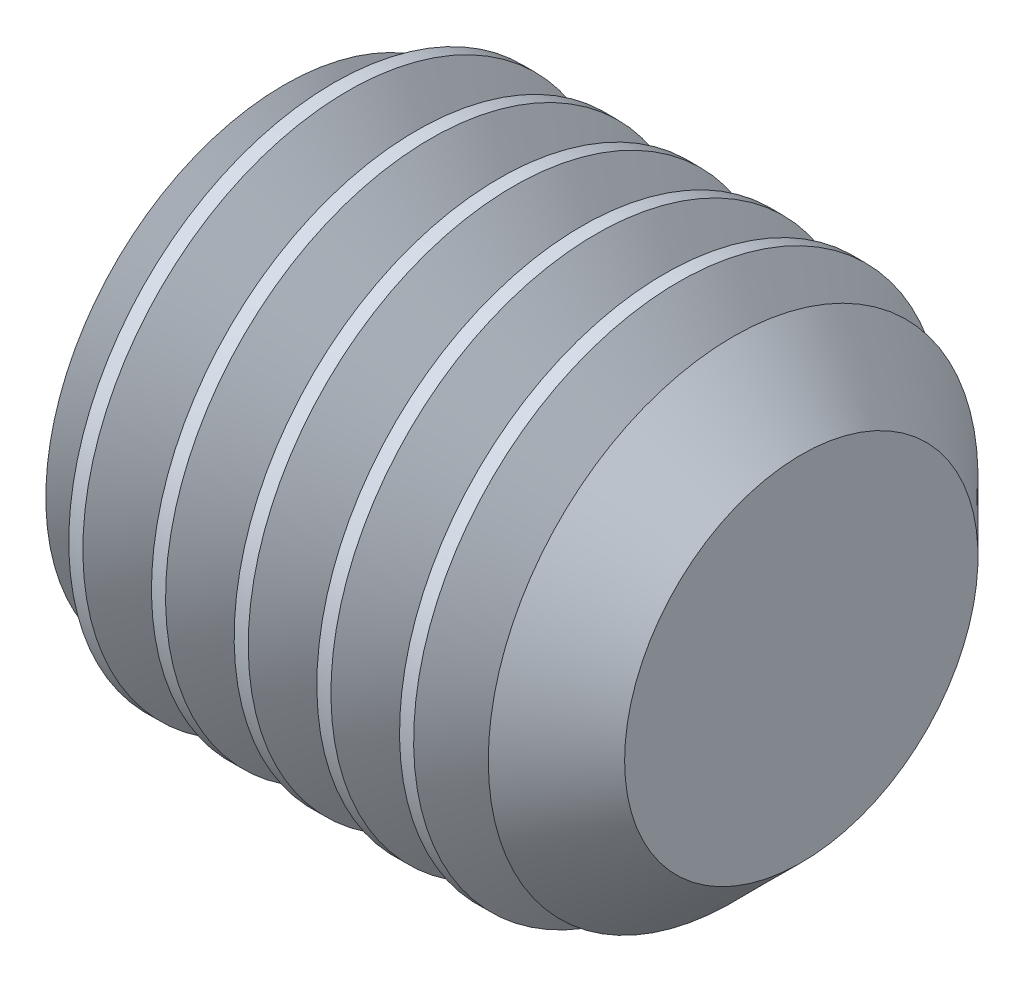
ISO-10303-21;
HEADER;
FILE_DESCRIPTION(('STEP AP214'),'2;1');
FILE_NAME('part.step','',(''),(''),'','','');
FILE_SCHEMA(('AUTOMOTIVE_DESIGN { 1 0 10303 214 1 1 1 1 }'));
ENDSEC;
DATA;
#1=APPLICATION_CONTEXT('core data for automotive mechanical design processes');
#2=APPLICATION_PROTOCOL_DEFINITION('international standard','automotive_design',2000,#1);
#3=PRODUCT_CONTEXT('',#1,'mechanical');
#4=PRODUCT('Part','Part','',(#3));
#5=PRODUCT_RELATED_PRODUCT_CATEGORY('part','',(#4));
#6=PRODUCT_DEFINITION_FORMATION('','',#4);
#7=PRODUCT_DEFINITION_CONTEXT('part definition',#1,'design');
#8=PRODUCT_DEFINITION('design','',#6,#7);
#9=PRODUCT_DEFINITION_SHAPE('','',#8);
#10=(LENGTH_UNIT() NAMED_UNIT(*) SI_UNIT(.MILLI.,.METRE.));
#11=(NAMED_UNIT(*) PLANE_ANGLE_UNIT() SI_UNIT($,.RADIAN.));
#12=(NAMED_UNIT(*) SI_UNIT($,.STERADIAN.) SOLID_ANGLE_UNIT());
#13=UNCERTAINTY_MEASURE_WITH_UNIT(LENGTH_MEASURE(1.E-05),#10,'distance_accuracy_value','');
#14=(GEOMETRIC_REPRESENTATION_CONTEXT(3) GLOBAL_UNCERTAINTY_ASSIGNED_CONTEXT((#13)) GLOBAL_UNIT_ASSIGNED_CONTEXT((#10,
#11,#12)) REPRESENTATION_CONTEXT('',''));
#15=CARTESIAN_POINT('',(0.,0.,0.));
#16=DIRECTION('',(0.,0.,1.));
#17=DIRECTION('',(1.,0.,0.));
#18=AXIS2_PLACEMENT_3D('',#15,#16,#17);
#19=CARTESIAN_POINT('',(2.,1.5,0.866025403784437));
#20=DIRECTION('',(1.,0.,0.));
#21=DIRECTION('',(0.,1.,0.));
#22=AXIS2_PLACEMENT_3D('',#19,#20,#21);
#23=PLANE('',#22);
#24=DIRECTION('',(0.,-0.866025403784438,-0.500000000000002));
#25=VECTOR('',#24,1.);
#26=CARTESIAN_POINT('',(2.,0.,1.3856406460551));
#27=LINE('',#26,#25);
#28=CARTESIAN_POINT('',(2.,0.,1.3856406460551));
#29=VERTEX_POINT('',#28);
#30=CARTESIAN_POINT('',(2.,-1.2,0.69282032302755));
#31=VERTEX_POINT('',#30);
#32=EDGE_CURVE('E138',#29,#31,#27,.T.);
#33=ORIENTED_EDGE('',*,*,#32,.F.);
#34=DIRECTION('',(0.,0.86602540378444,-0.499999999999998));
#35=VECTOR('',#34,1.);
#36=CARTESIAN_POINT('',(2.,0.,1.3856406460551));
#37=LINE('',#36,#35);
#38=CARTESIAN_POINT('',(2.,1.2,0.692820323027553));
#39=VERTEX_POINT('',#38);
#40=EDGE_CURVE('E131',#29,#39,#37,.T.);
#41=ORIENTED_EDGE('',*,*,#40,.T.);
#42=DIRECTION('',(0.,0.,1.));
#43=VECTOR('',#42,1.);
#44=CARTESIAN_POINT('',(2.00000000000001,1.2,0.866025403784438));
#45=LINE('',#44,#43);
#46=CARTESIAN_POINT('',(2.,1.2,-0.692820323027552));
#47=VERTEX_POINT('',#46);
#48=EDGE_CURVE('E119',#47,#39,#45,.T.);
#49=ORIENTED_EDGE('',*,*,#48,.F.);
#50=DIRECTION('',(0.,0.866025403784438,0.500000000000001));
#51=VECTOR('',#50,1.);
#52=CARTESIAN_POINT('',(2.,0.,-1.38564064605511));
#53=LINE('',#52,#51);
#54=CARTESIAN_POINT('',(2.,0.,-1.38564064605511));
#55=VERTEX_POINT('',#54);
#56=EDGE_CURVE('E103',#55,#47,#53,.T.);
#57=ORIENTED_EDGE('',*,*,#56,.F.);
#58=DIRECTION('',(0.,-0.866025403784438,0.500000000000001));
#59=VECTOR('',#58,1.);
#60=CARTESIAN_POINT('',(2.,0.,-1.38564064605511));
#61=LINE('',#60,#59);
#62=CARTESIAN_POINT('',(2.,-1.2,-0.692820323027556));
#63=VERTEX_POINT('',#62);
#64=EDGE_CURVE('E108',#55,#63,#61,.T.);
#65=ORIENTED_EDGE('',*,*,#64,.T.);
#66=DIRECTION('',(0.,0.,1.));
#67=VECTOR('',#66,1.);
#68=CARTESIAN_POINT('',(2.,-1.2,0.866025403784437));
#69=LINE('',#68,#67);
#70=EDGE_CURVE('E141',#63,#31,#69,.T.);
#71=ORIENTED_EDGE('',*,*,#70,.T.);
#72=EDGE_LOOP('',(#33,#41,#49,#57,#65,#71));
#73=FACE_BOUND('',#72,.T.);
#74=ADVANCED_FACE('F17',(#73),#23,.F.);
#75=CARTESIAN_POINT('',(1.70000000000001,-1.5,-0.866025403784441));
#76=DIRECTION('',(0.707106781186545,-0.353553390593275,-0.612372435695797));
#77=DIRECTION('',(-0.65465367070798,0.,-0.755928946018452));
#78=AXIS2_PLACEMENT_3D('',#75,#76,#77);
#79=PLANE('',#78);
#80=DIRECTION('',(0.,-0.866025403784439,0.5));
#81=VECTOR('',#80,1.);
#82=CARTESIAN_POINT('',(1.70000000000001,-1.5,-0.866025403784441));
#83=LINE('',#82,#81);
#84=CARTESIAN_POINT('',(1.70000000000001,-1.5,-0.866025403784441));
#85=VERTEX_POINT('',#84);
#86=CARTESIAN_POINT('',(1.7,0.,-1.73205080756888));
#87=VERTEX_POINT('',#86);
#88=EDGE_CURVE('E146',#85,#87,#83,.F.);
#89=ORIENTED_EDGE('',*,*,#88,.F.);
#90=DIRECTION('',(0.65465367070798,0.654653670707974,0.377964473009228));
#91=VECTOR('',#90,1.);
#92=CARTESIAN_POINT('',(1.7,-1.5,-0.866025403784442));
#93=LINE('',#92,#91);
#94=EDGE_CURVE('E113',#85,#63,#93,.T.);
#95=ORIENTED_EDGE('',*,*,#94,.T.);
#96=ORIENTED_EDGE('',*,*,#64,.F.);
#97=DIRECTION('',(0.65465367070798,0.,0.755928946018453));
#98=VECTOR('',#97,1.);
#99=CARTESIAN_POINT('',(2.6,0.,-0.692820323027556));
#100=LINE('',#99,#98);
#101=EDGE_CURVE('E110',#87,#55,#100,.T.);
#102=ORIENTED_EDGE('',*,*,#101,.F.);
#103=EDGE_LOOP('',(#89,#95,#96,#102));
#104=FACE_BOUND('',#103,.T.);
#105=ADVANCED_FACE('F109',(#104),#79,.F.);
#106=CARTESIAN_POINT('',(2.,2.1,-0.173205080756891));
#107=DIRECTION('',(-0.707106781186545,-0.353553390593275,0.612372435695796));
#108=DIRECTION('',(0.65465367070798,0.,0.755928946018453));
#109=AXIS2_PLACEMENT_3D('',#106,#107,#108);
#110=PLANE('',#109);
#111=ORIENTED_EDGE('',*,*,#101,.T.);
#112=ORIENTED_EDGE('',*,*,#56,.T.);
#113=DIRECTION('',(0.654653670707979,-0.654653670707975,0.377964473009227));
#114=VECTOR('',#113,1.);
#115=CARTESIAN_POINT('',(1.7,1.5,-0.86602540378444));
#116=LINE('',#115,#114);
#117=CARTESIAN_POINT('',(1.7,1.5,-0.86602540378444));
#118=VERTEX_POINT('',#117);
#119=EDGE_CURVE('E121',#118,#47,#116,.T.);
#120=ORIENTED_EDGE('',*,*,#119,.F.);
#121=DIRECTION('',(0.,0.866025403784439,0.5));
#122=VECTOR('',#121,1.);
#123=CARTESIAN_POINT('',(1.7,1.5,-0.86602540378444));
#124=LINE('',#123,#122);
#125=EDGE_CURVE('E125',#118,#87,#124,.F.);
#126=ORIENTED_EDGE('',*,*,#125,.T.);
#127=EDGE_LOOP('',(#111,#112,#120,#126));
#128=FACE_BOUND('',#127,.T.);
#129=ADVANCED_FACE('F123',(#128),#110,.T.);
#130=CARTESIAN_POINT('',(2.,1.2,0.866025403784438));
#131=DIRECTION('',(-0.707106781186545,-0.70710678118655,0.));
#132=DIRECTION('',(0.70710678118655,-0.707106781186545,0.));
#133=AXIS2_PLACEMENT_3D('',#130,#131,#132);
#134=PLANE('',#133);
#135=DIRECTION('',(-0.65465367070798,0.654653670707974,0.377964473009227));
#136=VECTOR('',#135,1.);
#137=CARTESIAN_POINT('',(2.,1.20000000000001,0.692820323027551));
#138=LINE('',#137,#136);
#139=CARTESIAN_POINT('',(1.7,1.5,0.866025403784437));
#140=VERTEX_POINT('',#139);
#141=EDGE_CURVE('E133',#39,#140,#138,.T.);
#142=ORIENTED_EDGE('',*,*,#141,.T.);
#143=DIRECTION('',(0.,0.,1.));
#144=VECTOR('',#143,1.);
#145=CARTESIAN_POINT('',(1.7,1.5,0.866025403784437));
#146=LINE('',#145,#144);
#147=EDGE_CURVE('E151',#140,#118,#146,.F.);
#148=ORIENTED_EDGE('',*,*,#147,.T.);
#149=ORIENTED_EDGE('',*,*,#119,.T.);
#150=ORIENTED_EDGE('',*,*,#48,.T.);
#151=EDGE_LOOP('',(#142,#148,#149,#150));
#152=FACE_BOUND('',#151,.T.);
#153=ADVANCED_FACE('F676',(#152),#134,.T.);
#154=CARTESIAN_POINT('',(1.7,1.5,0.866025403784437));
#155=DIRECTION('',(0.707106781186545,0.353553390593275,0.612372435695797));
#156=DIRECTION('',(0.65465367070798,0.,-0.755928946018452));
#157=AXIS2_PLACEMENT_3D('',#154,#155,#156);
#158=PLANE('',#157);
#159=ORIENTED_EDGE('',*,*,#40,.F.);
#160=DIRECTION('',(-0.65465367070798,0.,0.755928946018452));
#161=VECTOR('',#160,1.);
#162=CARTESIAN_POINT('',(1.74285714285714,0.,1.68256364163834));
#163=LINE('',#162,#161);
#164=CARTESIAN_POINT('',(1.7,0.,1.73205080756888));
#165=VERTEX_POINT('',#164);
#166=EDGE_CURVE('E135',#165,#29,#163,.F.);
#167=ORIENTED_EDGE('',*,*,#166,.F.);
#168=DIRECTION('',(0.,0.866025403784439,-0.5));
#169=VECTOR('',#168,1.);
#170=CARTESIAN_POINT('',(1.7,1.5,0.866025403784437));
#171=LINE('',#170,#169);
#172=EDGE_CURVE('E159',#140,#165,#171,.F.);
#173=ORIENTED_EDGE('',*,*,#172,.F.);
#174=ORIENTED_EDGE('',*,*,#141,.F.);
#175=EDGE_LOOP('',(#159,#167,#173,#174));
#176=FACE_BOUND('',#175,.T.);
#177=ADVANCED_FACE('F666',(#176),#158,.F.);
#178=CARTESIAN_POINT('',(2.,0.899999999999996,1.90525588832577));
#179=DIRECTION('',(-0.707106781186545,0.353553390593275,-0.612372435695797));
#180=DIRECTION('',(-0.65465367070798,0.,0.755928946018452));
#181=AXIS2_PLACEMENT_3D('',#178,#179,#180);
#182=PLANE('',#181);
#183=ORIENTED_EDGE('',*,*,#166,.T.);
#184=ORIENTED_EDGE('',*,*,#32,.T.);
#185=DIRECTION('',(-0.65465367070798,-0.654653670707975,0.377964473009225));
#186=VECTOR('',#185,1.);
#187=CARTESIAN_POINT('',(2.,-1.2,0.69282032302755));
#188=LINE('',#187,#186);
#189=CARTESIAN_POINT('',(1.7,-1.5,0.866025403784438));
#190=VERTEX_POINT('',#189);
#191=EDGE_CURVE('E143',#31,#190,#188,.T.);
#192=ORIENTED_EDGE('',*,*,#191,.T.);
#193=DIRECTION('',(0.,-0.866025403784439,-0.5));
#194=VECTOR('',#193,1.);
#195=CARTESIAN_POINT('',(1.7,-1.5,0.866025403784438));
#196=LINE('',#195,#194);
#197=EDGE_CURVE('E162',#190,#165,#196,.F.);
#198=ORIENTED_EDGE('',*,*,#197,.T.);
#199=EDGE_LOOP('',(#183,#184,#192,#198));
#200=FACE_BOUND('',#199,.T.);
#201=ADVANCED_FACE('F656',(#200),#182,.T.);
#202=CARTESIAN_POINT('',(1.7,-1.5,0.866025403784437));
#203=DIRECTION('',(0.707106781186545,-0.70710678118655,0.));
#204=DIRECTION('',(0.70710678118655,0.707106781186545,0.));
#205=AXIS2_PLACEMENT_3D('',#202,#203,#204);
#206=PLANE('',#205);
#207=DIRECTION('',(0.,0.,1.));
#208=VECTOR('',#207,1.);
#209=CARTESIAN_POINT('',(1.7,-1.5,0.866025403784438));
#210=LINE('',#209,#208);
#211=EDGE_CURVE('E170',#190,#85,#210,.F.);
#212=ORIENTED_EDGE('',*,*,#211,.F.);
#213=ORIENTED_EDGE('',*,*,#191,.F.);
#214=ORIENTED_EDGE('',*,*,#70,.F.);
#215=ORIENTED_EDGE('',*,*,#94,.F.);
#216=EDGE_LOOP('',(#212,#213,#214,#215));
#217=FACE_BOUND('',#216,.T.);
#218=ADVANCED_FACE('F646',(#217),#206,.F.);
#219=CARTESIAN_POINT('',(2.00000000000001,-1.5,-0.866025403784441));
#220=DIRECTION('',(0.,0.5,0.866025403784439));
#221=DIRECTION('',(0.,-0.866025403784439,0.5));
#222=AXIS2_PLACEMENT_3D('',#219,#220,#221);
#223=PLANE('',#222);
#224=DIRECTION('',(1.,0.,0.));
#225=VECTOR('',#224,1.);
#226=CARTESIAN_POINT('',(2.,0.,-1.73205080756888));
#227=LINE('',#226,#225);
#228=CARTESIAN_POINT('',(0.3,0.,-1.73205080756888));
#229=VERTEX_POINT('',#228);
#230=EDGE_CURVE('E149',#87,#229,#227,.F.);
#231=ORIENTED_EDGE('',*,*,#230,.T.);
#232=DIRECTION('',(0.,-0.866025403784438,0.500000000000001));
#233=VECTOR('',#232,1.);
#234=CARTESIAN_POINT('',(0.300000000000003,0.,-1.73205080756888));
#235=LINE('',#234,#233);
#236=CARTESIAN_POINT('',(0.300000000000002,-1.5,-0.866025403784442));
#237=VERTEX_POINT('',#236);
#238=EDGE_CURVE('E176',#229,#237,#235,.T.);
#239=ORIENTED_EDGE('',*,*,#238,.T.);
#240=DIRECTION('',(-1.,0.,0.));
#241=VECTOR('',#240,1.);
#242=CARTESIAN_POINT('',(2.00000000000001,-1.5,-0.866025403784441));
#243=LINE('',#242,#241);
#244=EDGE_CURVE('E173',#85,#237,#243,.T.);
#245=ORIENTED_EDGE('',*,*,#244,.F.);
#246=ORIENTED_EDGE('',*,*,#88,.T.);
#247=EDGE_LOOP('',(#231,#239,#245,#246));
#248=FACE_BOUND('',#247,.T.);
#249=ADVANCED_FACE('F636',(#248),#223,.T.);
#250=CARTESIAN_POINT('',(2.,1.5,-0.86602540378444));
#251=DIRECTION('',(0.,0.5,-0.866025403784439));
#252=DIRECTION('',(0.,0.866025403784439,0.5));
#253=AXIS2_PLACEMENT_3D('',#250,#251,#252);
#254=PLANE('',#253);
#255=ORIENTED_EDGE('',*,*,#125,.F.);
#256=DIRECTION('',(1.,0.,0.));
#257=VECTOR('',#256,1.);
#258=CARTESIAN_POINT('',(2.,1.5,-0.86602540378444));
#259=LINE('',#258,#257);
#260=CARTESIAN_POINT('',(0.300000000000002,1.5,-0.866025403784441));
#261=VERTEX_POINT('',#260);
#262=EDGE_CURVE('E154',#118,#261,#259,.F.);
#263=ORIENTED_EDGE('',*,*,#262,.T.);
#264=DIRECTION('',(0.,0.866025403784437,0.500000000000003));
#265=VECTOR('',#264,1.);
#266=CARTESIAN_POINT('',(0.299999999999999,0.,-1.73205080756888));
#267=LINE('',#266,#265);
#268=EDGE_CURVE('E181',#229,#261,#267,.T.);
#269=ORIENTED_EDGE('',*,*,#268,.F.);
#270=ORIENTED_EDGE('',*,*,#230,.F.);
#271=EDGE_LOOP('',(#255,#263,#269,#270));
#272=FACE_BOUND('',#271,.T.);
#273=ADVANCED_FACE('F626',(#272),#254,.F.);
#274=CARTESIAN_POINT('',(2.,1.5,0.866025403784437));
#275=DIRECTION('',(0.,1.,0.));
#276=DIRECTION('',(0.,0.,1.));
#277=AXIS2_PLACEMENT_3D('',#274,#275,#276);
#278=PLANE('',#277);
#279=ORIENTED_EDGE('',*,*,#147,.F.);
#280=DIRECTION('',(1.,0.,0.));
#281=VECTOR('',#280,1.);
#282=CARTESIAN_POINT('',(2.,1.5,0.866025403784439));
#283=LINE('',#282,#281);
#284=CARTESIAN_POINT('',(0.300000000000003,1.5,0.866025403784438));
#285=VERTEX_POINT('',#284);
#286=EDGE_CURVE('E156',#285,#140,#283,.T.);
#287=ORIENTED_EDGE('',*,*,#286,.F.);
#288=DIRECTION('',(0.,0.,1.));
#289=VECTOR('',#288,1.);
#290=CARTESIAN_POINT('',(0.300000000000005,1.5,0.866025403784438));
#291=LINE('',#290,#289);
#292=EDGE_CURVE('E187',#261,#285,#291,.T.);
#293=ORIENTED_EDGE('',*,*,#292,.F.);
#294=ORIENTED_EDGE('',*,*,#262,.F.);
#295=EDGE_LOOP('',(#279,#287,#293,#294));
#296=FACE_BOUND('',#295,.T.);
#297=ADVANCED_FACE('F616',(#296),#278,.F.);
#298=CARTESIAN_POINT('',(2.,1.5,0.866025403784437));
#299=DIRECTION('',(0.,-0.5,-0.866025403784439));
#300=DIRECTION('',(0.,0.866025403784439,-0.5));
#301=AXIS2_PLACEMENT_3D('',#298,#299,#300);
#302=PLANE('',#301);
#303=DIRECTION('',(1.,0.,0.));
#304=VECTOR('',#303,1.);
#305=CARTESIAN_POINT('',(2.00000000000001,0.,1.73205080756887));
#306=LINE('',#305,#304);
#307=CARTESIAN_POINT('',(0.299999999999998,0.,1.73205080756888));
#308=VERTEX_POINT('',#307);
#309=EDGE_CURVE('E165',#165,#308,#306,.F.);
#310=ORIENTED_EDGE('',*,*,#309,.T.);
#311=DIRECTION('',(0.,0.866025403784439,-0.5));
#312=VECTOR('',#311,1.);
#313=CARTESIAN_POINT('',(0.299999999999998,0.,1.73205080756888));
#314=LINE('',#313,#312);
#315=EDGE_CURVE('E190',#308,#285,#314,.T.);
#316=ORIENTED_EDGE('',*,*,#315,.T.);
#317=ORIENTED_EDGE('',*,*,#286,.T.);
#318=ORIENTED_EDGE('',*,*,#172,.T.);
#319=EDGE_LOOP('',(#310,#316,#317,#318));
#320=FACE_BOUND('',#319,.T.);
#321=ADVANCED_FACE('F606',(#320),#302,.T.);
#322=CARTESIAN_POINT('',(2.00000000000001,-1.5,0.866025403784438));
#323=DIRECTION('',(0.,-0.5,0.866025403784439));
#324=DIRECTION('',(0.,-0.866025403784439,-0.5));
#325=AXIS2_PLACEMENT_3D('',#322,#323,#324);
#326=PLANE('',#325);
#327=ORIENTED_EDGE('',*,*,#197,.F.);
#328=DIRECTION('',(-1.,0.,0.));
#329=VECTOR('',#328,1.);
#330=CARTESIAN_POINT('',(2.00000000000001,-1.5,0.866025403784438));
#331=LINE('',#330,#329);
#332=CARTESIAN_POINT('',(0.300000000000001,-1.5,0.866025403784438));
#333=VERTEX_POINT('',#332);
#334=EDGE_CURVE('E167',#333,#190,#331,.F.);
#335=ORIENTED_EDGE('',*,*,#334,.F.);
#336=DIRECTION('',(0.,-0.866025403784437,-0.500000000000003));
#337=VECTOR('',#336,1.);
#338=CARTESIAN_POINT('',(0.299999999999999,0.,1.73205080756888));
#339=LINE('',#338,#337);
#340=EDGE_CURVE('E198',#308,#333,#339,.T.);
#341=ORIENTED_EDGE('',*,*,#340,.F.);
#342=ORIENTED_EDGE('',*,*,#309,.F.);
#343=EDGE_LOOP('',(#327,#335,#341,#342));
#344=FACE_BOUND('',#343,.T.);
#345=ADVANCED_FACE('F596',(#344),#326,.F.);
#346=CARTESIAN_POINT('',(2.00000000000001,-1.5,0.866025403784438));
#347=DIRECTION('',(0.,1.,0.));
#348=DIRECTION('',(-1.,0.,0.));
#349=AXIS2_PLACEMENT_3D('',#346,#347,#348);
#350=PLANE('',#349);
#351=ORIENTED_EDGE('',*,*,#244,.T.);
#352=DIRECTION('',(0.,0.,1.));
#353=VECTOR('',#352,1.);
#354=CARTESIAN_POINT('',(0.300000000000004,-1.5,0.));
#355=LINE('',#354,#353);
#356=EDGE_CURVE('E203',#237,#333,#355,.T.);
#357=ORIENTED_EDGE('',*,*,#356,.T.);
#358=ORIENTED_EDGE('',*,*,#334,.T.);
#359=ORIENTED_EDGE('',*,*,#211,.T.);
#360=EDGE_LOOP('',(#351,#357,#358,#359));
#361=FACE_BOUND('',#360,.T.);
#362=ADVANCED_FACE('F586',(#361),#350,.T.);
#363=CARTESIAN_POINT('',(0.,-0.900000000000007,-1.55884572681199));
#364=DIRECTION('',(0.70710678118655,-0.353553390593272,-0.612372435695793));
#365=DIRECTION('',(-0.654653670707975,0.,-0.755928946018456));
#366=AXIS2_PLACEMENT_3D('',#363,#364,#365);
#367=PLANE('',#366);
#368=ORIENTED_EDGE('',*,*,#238,.F.);
#369=DIRECTION('',(0.654653670707975,0.,0.755928946018456));
#370=VECTOR('',#369,1.);
#371=CARTESIAN_POINT('',(0.728571428571432,0.,-1.23717914826348));
#372=LINE('',#371,#370);
#373=CARTESIAN_POINT('',(0.,0.,-2.07846096908266));
#374=VERTEX_POINT('',#373);
#375=EDGE_CURVE('E178',#374,#229,#372,.T.);
#376=ORIENTED_EDGE('',*,*,#375,.F.);
#377=DIRECTION('',(0.,0.866025403784438,-0.500000000000001));
#378=VECTOR('',#377,1.);
#379=CARTESIAN_POINT('',(0.,-1.8,-1.03923048454133));
#380=LINE('',#379,#378);
#381=CARTESIAN_POINT('',(0.,-1.8,-1.03923048454133));
#382=VERTEX_POINT('',#381);
#383=EDGE_CURVE('E207',#382,#374,#380,.T.);
#384=ORIENTED_EDGE('',*,*,#383,.F.);
#385=DIRECTION('',(0.654653670707974,0.654653670707977,0.377964473009234));
#386=VECTOR('',#385,1.);
#387=CARTESIAN_POINT('',(0.,-1.8,-1.03923048454133));
#388=LINE('',#387,#386);
#389=EDGE_CURVE('E200',#382,#237,#388,.T.);
#390=ORIENTED_EDGE('',*,*,#389,.T.);
#391=EDGE_LOOP('',(#368,#376,#384,#390));
#392=FACE_BOUND('',#391,.T.);
#393=ADVANCED_FACE('F576',(#392),#367,.F.);
#394=CARTESIAN_POINT('',(0.300000000000005,1.5,-0.86602540378444));
#395=DIRECTION('',(-0.707106781186549,-0.353553390593273,0.612372435695793));
#396=DIRECTION('',(0.654653670707975,0.,0.755928946018456));
#397=AXIS2_PLACEMENT_3D('',#394,#395,#396);
#398=PLANE('',#397);
#399=ORIENTED_EDGE('',*,*,#375,.T.);
#400=ORIENTED_EDGE('',*,*,#268,.T.);
#401=DIRECTION('',(0.654653670707976,-0.65465367070798,0.377964473009223));
#402=VECTOR('',#401,1.);
#403=CARTESIAN_POINT('',(0.,1.8,-1.03923048454133));
#404=LINE('',#403,#402);
#405=CARTESIAN_POINT('',(0.,1.8,-1.03923048454133));
#406=VERTEX_POINT('',#405);
#407=EDGE_CURVE('E184',#406,#261,#404,.T.);
#408=ORIENTED_EDGE('',*,*,#407,.F.);
#409=DIRECTION('',(0.,0.866025403784438,0.500000000000001));
#410=VECTOR('',#409,1.);
#411=CARTESIAN_POINT('',(0.,0.,-2.07846096908266));
#412=LINE('',#411,#410);
#413=EDGE_CURVE('E210',#374,#406,#412,.T.);
#414=ORIENTED_EDGE('',*,*,#413,.F.);
#415=EDGE_LOOP('',(#399,#400,#408,#414));
#416=FACE_BOUND('',#415,.T.);
#417=ADVANCED_FACE('F566',(#416),#398,.T.);
#418=CARTESIAN_POINT('',(0.300000000000002,1.5,0.866025403784438));
#419=DIRECTION('',(-0.707106781186549,-0.707106781186546,0.));
#420=DIRECTION('',(0.707106781186546,-0.707106781186549,0.));
#421=AXIS2_PLACEMENT_3D('',#418,#419,#420);
#422=PLANE('',#421);
#423=ORIENTED_EDGE('',*,*,#407,.T.);
#424=ORIENTED_EDGE('',*,*,#292,.T.);
#425=DIRECTION('',(-0.654653670707978,0.654653670707972,0.377964473009234));
#426=VECTOR('',#425,1.);
#427=CARTESIAN_POINT('',(0.3,1.5,0.866025403784437));
#428=LINE('',#427,#426);
#429=CARTESIAN_POINT('',(0.,1.8,1.03923048454132));
#430=VERTEX_POINT('',#429);
#431=EDGE_CURVE('E193',#285,#430,#428,.T.);
#432=ORIENTED_EDGE('',*,*,#431,.T.);
#433=DIRECTION('',(0.,0.,1.));
#434=VECTOR('',#433,1.);
#435=CARTESIAN_POINT('',(0.,1.8,0.));
#436=LINE('',#435,#434);
#437=EDGE_CURVE('E213',#406,#430,#436,.T.);
#438=ORIENTED_EDGE('',*,*,#437,.F.);
#439=EDGE_LOOP('',(#423,#424,#432,#438));
#440=FACE_BOUND('',#439,.T.);
#441=ADVANCED_FACE('F556',(#440),#422,.T.);
#442=CARTESIAN_POINT('',(0.,0.899999999999995,1.55884572681199));
#443=DIRECTION('',(0.707106781186549,0.353553390593273,0.612372435695794));
#444=DIRECTION('',(0.654653670707976,0.,-0.755928946018456));
#445=AXIS2_PLACEMENT_3D('',#442,#443,#444);
#446=PLANE('',#445);
#447=DIRECTION('',(0.,-0.866025403784438,0.5));
#448=VECTOR('',#447,1.);
#449=CARTESIAN_POINT('',(0.,1.79999999999999,1.03923048454133));
#450=LINE('',#449,#448);
#451=CARTESIAN_POINT('',(0.,0.,2.07846096908265));
#452=VERTEX_POINT('',#451);
#453=EDGE_CURVE('E216',#430,#452,#450,.T.);
#454=ORIENTED_EDGE('',*,*,#453,.F.);
#455=ORIENTED_EDGE('',*,*,#431,.F.);
#456=ORIENTED_EDGE('',*,*,#315,.F.);
#457=DIRECTION('',(-0.654653670707976,0.,0.755928946018456));
#458=VECTOR('',#457,1.);
#459=CARTESIAN_POINT('',(0.728571428571431,0.,1.23717914826348));
#460=LINE('',#459,#458);
#461=EDGE_CURVE('E195',#452,#308,#460,.F.);
#462=ORIENTED_EDGE('',*,*,#461,.F.);
#463=EDGE_LOOP('',(#454,#455,#456,#462));
#464=FACE_BOUND('',#463,.T.);
#465=ADVANCED_FACE('F547',(#464),#446,.F.);
#466=CARTESIAN_POINT('',(0.300000000000005,-1.5,0.866025403784438));
#467=DIRECTION('',(-0.707106781186549,0.353553390593273,-0.612372435695793));
#468=DIRECTION('',(-0.654653670707976,0.,0.755928946018456));
#469=AXIS2_PLACEMENT_3D('',#466,#467,#468);
#470=PLANE('',#469);
#471=ORIENTED_EDGE('',*,*,#461,.T.);
#472=ORIENTED_EDGE('',*,*,#340,.T.);
#473=DIRECTION('',(-0.654653670707977,-0.65465367070798,0.377964473009222));
#474=VECTOR('',#473,1.);
#475=CARTESIAN_POINT('',(0.300000000000006,-1.5,0.866025403784438));
#476=LINE('',#475,#474);
#477=CARTESIAN_POINT('',(0.,-1.8,1.03923048454132));
#478=VERTEX_POINT('',#477);
#479=EDGE_CURVE('E34',#333,#478,#476,.T.);
#480=ORIENTED_EDGE('',*,*,#479,.T.);
#481=DIRECTION('',(0.,-0.866025403784439,-0.5));
#482=VECTOR('',#481,1.);
#483=CARTESIAN_POINT('',(0.,0.,2.07846096908265));
#484=LINE('',#483,#482);
#485=EDGE_CURVE('E219',#452,#478,#484,.T.);
#486=ORIENTED_EDGE('',*,*,#485,.F.);
#487=EDGE_LOOP('',(#471,#472,#480,#486));
#488=FACE_BOUND('',#487,.T.);
#489=ADVANCED_FACE('F537',(#488),#470,.T.);
#490=CARTESIAN_POINT('',(0.,-1.8,0.));
#491=DIRECTION('',(0.707106781186549,-0.707106781186546,0.));
#492=DIRECTION('',(0.707106781186546,0.707106781186549,0.));
#493=AXIS2_PLACEMENT_3D('',#490,#491,#492);
#494=PLANE('',#493);
#495=ORIENTED_EDGE('',*,*,#356,.F.);
#496=ORIENTED_EDGE('',*,*,#389,.F.);
#497=DIRECTION('',(0.,0.,1.));
#498=VECTOR('',#497,1.);
#499=CARTESIAN_POINT('',(0.,-1.80000000000001,0.));
#500=LINE('',#499,#498);
#501=EDGE_CURVE('E222',#478,#382,#500,.F.);
#502=ORIENTED_EDGE('',*,*,#501,.F.);
#503=ORIENTED_EDGE('',*,*,#479,.F.);
#504=EDGE_LOOP('',(#495,#496,#502,#503));
#505=FACE_BOUND('',#504,.T.);
#506=ADVANCED_FACE('F527',(#505),#494,.F.);
#507=CARTESIAN_POINT('',(0.,0.,0.));
#508=DIRECTION('',(-1.,0.,0.));
#509=DIRECTION('',(0.,-1.,0.));
#510=AXIS2_PLACEMENT_3D('',#507,#508,#509);
#511=PLANE('',#510);
#512=CARTESIAN_POINT('',(8.79366566543249E-12,0.,0.));
#513=DIRECTION('',(1.,0.,0.));
#514=DIRECTION('',(0.,1.,0.));
#515=AXIS2_PLACEMENT_3D('',#512,#513,#514);
#516=CIRCLE('',#515,2.44550000002164);
#517=CARTESIAN_POINT('',(8.79353044367804E-12,2.44550000002164,0.));
#518=VERTEX_POINT('',#517);
#519=EDGE_CURVE('E20',#518,#518,#516,.T.);
#520=ORIENTED_EDGE('',*,*,#519,.F.);
#521=EDGE_LOOP('',(#520));
#522=FACE_BOUND('',#521,.T.);
#523=ORIENTED_EDGE('',*,*,#485,.T.);
#524=ORIENTED_EDGE('',*,*,#501,.T.);
#525=ORIENTED_EDGE('',*,*,#383,.T.);
#526=ORIENTED_EDGE('',*,*,#413,.T.);
#527=ORIENTED_EDGE('',*,*,#437,.T.);
#528=ORIENTED_EDGE('',*,*,#453,.T.);
#529=EDGE_LOOP('',(#523,#524,#525,#526,#527,#528));
#530=FACE_BOUND('',#529,.T.);
#531=ADVANCED_FACE('F517',(#522,#530),#511,.T.);
#532=CARTESIAN_POINT('',(0.144677080186284,0.,0.));
#533=DIRECTION('',(1.,0.,0.));
#534=DIRECTION('',(0.,1.,0.));
#535=AXIS2_PLACEMENT_3D('',#532,#533,#534);
#536=CONICAL_SURFACE('',#535,2.69608805359667,1.0471975512258);
#537=ORIENTED_EDGE('',*,*,#519,.T.);
#538=EDGE_LOOP('',(#537));
#539=FACE_BOUND('',#538,.T.);
#540=CARTESIAN_POINT('',(0.144677080243127,0.,0.));
#541=DIRECTION('',(-1.,0.,0.));
#542=DIRECTION('',(0.,-1.,0.));
#543=AXIS2_PLACEMENT_3D('',#540,#541,#542);
#544=CIRCLE('',#543,2.69608805359666);
#545=CARTESIAN_POINT('',(0.144677080243127,-2.69608805359667,0.));
#546=VERTEX_POINT('',#545);
#547=EDGE_CURVE('E227',#546,#546,#544,.F.);
#548=ORIENTED_EDGE('',*,*,#547,.F.);
#549=EDGE_LOOP('',(#548));
#550=FACE_BOUND('',#549,.T.);
#551=ADVANCED_FACE('F507',(#539,#550),#536,.T.);
#552=CARTESIAN_POINT('',(0.144677080186284,0.,0.));
#553=DIRECTION('',(-1.,0.,0.));
#554=DIRECTION('',(0.,-1.,0.));
#555=AXIS2_PLACEMENT_3D('',#552,#553,#554);
#556=CONICAL_SURFACE('',#555,2.69608805371035,0.9599310885988);
#557=CARTESIAN_POINT('',(0.320140724284102,0.,0.));
#558=DIRECTION('',(1.,0.,0.));
#559=DIRECTION('',(0.,1.,0.));
#560=AXIS2_PLACEMENT_3D('',#557,#558,#559);
#561=CIRCLE('',#560,2.44550000002164);
#562=CARTESIAN_POINT('',(0.320140724284101,2.44550000002164,0.));
#563=VERTEX_POINT('',#562);
#564=EDGE_CURVE('E230',#563,#563,#561,.T.);
#565=ORIENTED_EDGE('',*,*,#564,.F.);
#566=EDGE_LOOP('',(#565));
#567=FACE_BOUND('',#566,.T.);
#568=ORIENTED_EDGE('',*,*,#547,.T.);
#569=EDGE_LOOP('',(#568));
#570=FACE_BOUND('',#569,.T.);
#571=ADVANCED_FACE('F497',(#567,#570),#556,.T.);
#572=CARTESIAN_POINT('',(0.708405804232371,0.,0.));
#573=DIRECTION('',(1.,0.,0.));
#574=DIRECTION('',(0.,1.,0.));
#575=AXIS2_PLACEMENT_3D('',#572,#573,#574);
#576=CONICAL_SURFACE('',#575,3.00000000004274,0.959931088601473);
#577=CARTESIAN_POINT('',(0.708405804202929,0.,0.));
#578=DIRECTION('',(-1.,0.,0.));
#579=DIRECTION('',(0.,-1.,0.));
#580=AXIS2_PLACEMENT_3D('',#577,#578,#579);
#581=CIRCLE('',#580,3.);
#582=CARTESIAN_POINT('',(0.708405804202929,-3.,0.));
#583=VERTEX_POINT('',#582);
#584=EDGE_CURVE('E235',#583,#583,#581,.F.);
#585=ORIENTED_EDGE('',*,*,#584,.F.);
#586=EDGE_LOOP('',(#585));
#587=FACE_BOUND('',#586,.T.);
#588=ORIENTED_EDGE('',*,*,#564,.T.);
#589=EDGE_LOOP('',(#588));
#590=FACE_BOUND('',#589,.T.);
#591=ADVANCED_FACE('F487',(#587,#590),#576,.T.);
#592=CARTESIAN_POINT('',(-12.7,0.,0.));
#593=DIRECTION('',(-1.,0.,0.));
#594=DIRECTION('',(0.,-1.,0.));
#595=AXIS2_PLACEMENT_3D('',#592,#593,#594);
#596=CYLINDRICAL_SURFACE('',#595,3.);
#597=ORIENTED_EDGE('',*,*,#584,.T.);
#598=EDGE_LOOP('',(#597));
#599=FACE_BOUND('',#598,.T.);
#600=CARTESIAN_POINT('',(0.867847504252949,0.,0.));
#601=DIRECTION('',(-1.,0.,0.));
#602=DIRECTION('',(0.,-1.,0.));
#603=AXIS2_PLACEMENT_3D('',#600,#601,#602);
#604=CIRCLE('',#603,3.00000000009959);
#605=CARTESIAN_POINT('',(0.86784750425295,-3.00000000009959,0.));
#606=VERTEX_POINT('',#605);
#607=EDGE_CURVE('E240',#606,#606,#604,.F.);
#608=ORIENTED_EDGE('',*,*,#607,.F.);
#609=EDGE_LOOP('',(#608));
#610=FACE_BOUND('',#609,.T.);
#611=ADVANCED_FACE('F477',(#599,#610),#596,.T.);
#612=CARTESIAN_POINT('',(0.867847504196106,0.,0.));
#613=DIRECTION('',(-1.,0.,0.));
#614=DIRECTION('',(0.,-1.,0.));
#615=AXIS2_PLACEMENT_3D('',#612,#613,#614);
#616=CONICAL_SURFACE('',#615,3.00000000015643,0.959931088601473);
#617=CARTESIAN_POINT('',(1.25611258420122,0.,0.));
#618=DIRECTION('',(1.,0.,0.));
#619=DIRECTION('',(0.,1.,0.));
#620=AXIS2_PLACEMENT_3D('',#617,#618,#619);
#621=CIRCLE('',#620,2.44550000002165);
#622=CARTESIAN_POINT('',(1.25611258420122,2.44550000002164,0.));
#623=VERTEX_POINT('',#622);
#624=EDGE_CURVE('E245',#623,#623,#621,.T.);
#625=ORIENTED_EDGE('',*,*,#624,.F.);
#626=EDGE_LOOP('',(#625));
#627=FACE_BOUND('',#626,.T.);
#628=ORIENTED_EDGE('',*,*,#607,.T.);
#629=EDGE_LOOP('',(#628));
#630=FACE_BOUND('',#629,.T.);
#631=ADVANCED_FACE('F467',(#627,#630),#616,.T.);
#632=CARTESIAN_POINT('',(1.64437766409264,0.,0.));
#633=DIRECTION('',(1.,0.,0.));
#634=DIRECTION('',(0.,1.,0.));
#635=AXIS2_PLACEMENT_3D('',#632,#633,#634);
#636=CONICAL_SURFACE('',#635,2.99999999992907,0.95993108857393);
#637=CARTESIAN_POINT('',(1.64437766409584,0.,0.));
#638=DIRECTION('',(-1.,0.,0.));
#639=DIRECTION('',(0.,-1.,0.));
#640=AXIS2_PLACEMENT_3D('',#637,#638,#639);
#641=CIRCLE('',#640,3.);
#642=CARTESIAN_POINT('',(1.64437766409584,-3.,0.));
#643=VERTEX_POINT('',#642);
#644=EDGE_CURVE('E250',#643,#643,#641,.F.);
#645=ORIENTED_EDGE('',*,*,#644,.F.);
#646=EDGE_LOOP('',(#645));
#647=FACE_BOUND('',#646,.T.);
#648=ORIENTED_EDGE('',*,*,#624,.T.);
#649=EDGE_LOOP('',(#648));
#650=FACE_BOUND('',#649,.T.);
#651=ADVANCED_FACE('F457',(#647,#650),#636,.T.);
#652=CARTESIAN_POINT('',(-12.7,0.,0.));
#653=DIRECTION('',(-1.,0.,0.));
#654=DIRECTION('',(0.,-1.,0.));
#655=AXIS2_PLACEMENT_3D('',#652,#653,#654);
#656=CYLINDRICAL_SURFACE('',#655,3.);
#657=ORIENTED_EDGE('',*,*,#644,.T.);
#658=EDGE_LOOP('',(#657));
#659=FACE_BOUND('',#658,.T.);
#660=CARTESIAN_POINT('',(1.80381936417007,0.,0.));
#661=DIRECTION('',(-1.,0.,0.));
#662=DIRECTION('',(0.,-1.,0.));
#663=AXIS2_PLACEMENT_3D('',#660,#661,#662);
#664=CIRCLE('',#663,3.00000000009958);
#665=CARTESIAN_POINT('',(1.80381936417007,-3.00000000009959,0.));
#666=VERTEX_POINT('',#665);
#667=EDGE_CURVE('E255',#666,#666,#664,.F.);
#668=ORIENTED_EDGE('',*,*,#667,.F.);
#669=EDGE_LOOP('',(#668));
#670=FACE_BOUND('',#669,.T.);
#671=ADVANCED_FACE('F447',(#659,#670),#656,.T.);
#672=CARTESIAN_POINT('',(1.80381936411322,0.,0.));
#673=DIRECTION('',(-1.,0.,0.));
#674=DIRECTION('',(0.,-1.,0.));
#675=AXIS2_PLACEMENT_3D('',#672,#673,#674);
#676=CONICAL_SURFACE('',#675,3.00000000015642,0.959931088601473);
#677=CARTESIAN_POINT('',(2.19208444411834,0.,0.));
#678=DIRECTION('',(1.,0.,0.));
#679=DIRECTION('',(0.,1.,0.));
#680=AXIS2_PLACEMENT_3D('',#677,#678,#679);
#681=CIRCLE('',#680,2.44550000002164);
#682=CARTESIAN_POINT('',(2.19208444411834,2.44550000002164,0.));
#683=VERTEX_POINT('',#682);
#684=EDGE_CURVE('E260',#683,#683,#681,.T.);
#685=ORIENTED_EDGE('',*,*,#684,.F.);
#686=EDGE_LOOP('',(#685));
#687=FACE_BOUND('',#686,.T.);
#688=ORIENTED_EDGE('',*,*,#667,.T.);
#689=EDGE_LOOP('',(#688));
#690=FACE_BOUND('',#689,.T.);
#691=ADVANCED_FACE('F437',(#687,#690),#676,.T.);
#692=CARTESIAN_POINT('',(2.58034952400976,0.,0.));
#693=DIRECTION('',(1.,0.,0.));
#694=DIRECTION('',(0.,1.,0.));
#695=AXIS2_PLACEMENT_3D('',#692,#693,#694);
#696=CONICAL_SURFACE('',#695,2.99999999992906,0.95993108857393);
#697=CARTESIAN_POINT('',(2.58034952398875,0.,0.));
#698=DIRECTION('',(-1.,0.,0.));
#699=DIRECTION('',(0.,-1.,0.));
#700=AXIS2_PLACEMENT_3D('',#697,#698,#699);
#701=CIRCLE('',#700,3.);
#702=CARTESIAN_POINT('',(2.58034952398875,-3.,0.));
#703=VERTEX_POINT('',#702);
#704=EDGE_CURVE('E265',#703,#703,#701,.F.);
#705=ORIENTED_EDGE('',*,*,#704,.F.);
#706=EDGE_LOOP('',(#705));
#707=FACE_BOUND('',#706,.T.);
#708=ORIENTED_EDGE('',*,*,#684,.T.);
#709=EDGE_LOOP('',(#708));
#710=FACE_BOUND('',#709,.T.);
#711=ADVANCED_FACE('F427',(#707,#710),#696,.T.);
#712=CARTESIAN_POINT('',(-12.7,0.,0.));
#713=DIRECTION('',(-1.,0.,0.));
#714=DIRECTION('',(0.,-1.,0.));
#715=AXIS2_PLACEMENT_3D('',#712,#713,#714);
#716=CYLINDRICAL_SURFACE('',#715,3.);
#717=ORIENTED_EDGE('',*,*,#704,.T.);
#718=EDGE_LOOP('',(#717));
#719=FACE_BOUND('',#718,.T.);
#720=CARTESIAN_POINT('',(2.73979122403034,0.,0.));
#721=DIRECTION('',(-1.,0.,0.));
#722=DIRECTION('',(0.,-1.,0.));
#723=AXIS2_PLACEMENT_3D('',#720,#721,#722);
#724=CIRCLE('',#723,2.9999999999859);
#725=CARTESIAN_POINT('',(2.73979122403034,-2.9999999999859,0.));
#726=VERTEX_POINT('',#725);
#727=EDGE_CURVE('E270',#726,#726,#724,.F.);
#728=ORIENTED_EDGE('',*,*,#727,.F.);
#729=EDGE_LOOP('',(#728));
#730=FACE_BOUND('',#729,.T.);
#731=ADVANCED_FACE('F417',(#719,#730),#716,.T.);
#732=CARTESIAN_POINT('',(2.73979122414403,0.,0.));
#733=DIRECTION('',(-1.,0.,0.));
#734=DIRECTION('',(0.,-1.,0.));
#735=AXIS2_PLACEMENT_3D('',#732,#733,#734);
#736=CONICAL_SURFACE('',#735,2.99999999975853,0.959931088601473);
#737=CARTESIAN_POINT('',(3.12805630397861,0.,0.));
#738=DIRECTION('',(1.,0.,0.));
#739=DIRECTION('',(0.,1.,0.));
#740=AXIS2_PLACEMENT_3D('',#737,#738,#739);
#741=CIRCLE('',#740,2.44550000002164);
#742=CARTESIAN_POINT('',(3.12805630397861,2.44550000002164,0.));
#743=VERTEX_POINT('',#742);
#744=EDGE_CURVE('E275',#743,#743,#741,.T.);
#745=ORIENTED_EDGE('',*,*,#744,.F.);
#746=EDGE_LOOP('',(#745));
#747=FACE_BOUND('',#746,.T.);
#748=ORIENTED_EDGE('',*,*,#727,.T.);
#749=EDGE_LOOP('',(#748));
#750=FACE_BOUND('',#749,.T.);
#751=ADVANCED_FACE('F407',(#747,#750),#736,.T.);
#752=CARTESIAN_POINT('',(3.51632138392688,0.,0.));
#753=DIRECTION('',(1.,0.,0.));
#754=DIRECTION('',(0.,1.,0.));
#755=AXIS2_PLACEMENT_3D('',#752,#753,#754);
#756=CONICAL_SURFACE('',#755,3.00000000004275,0.959931088601473);
#757=CARTESIAN_POINT('',(3.51632138388167,0.,0.));
#758=DIRECTION('',(-1.,0.,0.));
#759=DIRECTION('',(0.,-1.,0.));
#760=AXIS2_PLACEMENT_3D('',#757,#758,#759);
#761=CIRCLE('',#760,3.);
#762=CARTESIAN_POINT('',(3.51632138388167,-3.,0.));
#763=VERTEX_POINT('',#762);
#764=EDGE_CURVE('E280',#763,#763,#761,.F.);
#765=ORIENTED_EDGE('',*,*,#764,.F.);
#766=EDGE_LOOP('',(#765));
#767=FACE_BOUND('',#766,.T.);
#768=ORIENTED_EDGE('',*,*,#744,.T.);
#769=EDGE_LOOP('',(#768));
#770=FACE_BOUND('',#769,.T.);
#771=ADVANCED_FACE('F397',(#767,#770),#756,.T.);
#772=CARTESIAN_POINT('',(-12.7,0.,0.));
#773=DIRECTION('',(-1.,0.,0.));
#774=DIRECTION('',(0.,-1.,0.));
#775=AXIS2_PLACEMENT_3D('',#772,#773,#774);
#776=CYLINDRICAL_SURFACE('',#775,3.);
#777=ORIENTED_EDGE('',*,*,#764,.T.);
#778=EDGE_LOOP('',(#777));
#779=FACE_BOUND('',#778,.T.);
#780=CARTESIAN_POINT('',(3.67576308394746,0.,0.));
#781=DIRECTION('',(-1.,0.,0.));
#782=DIRECTION('',(0.,-1.,0.));
#783=AXIS2_PLACEMENT_3D('',#780,#781,#782);
#784=CIRCLE('',#783,3.00000000004275);
#785=CARTESIAN_POINT('',(3.67576308394746,-3.00000000004275,0.));
#786=VERTEX_POINT('',#785);
#787=EDGE_CURVE('E285',#786,#786,#784,.F.);
#788=ORIENTED_EDGE('',*,*,#787,.F.);
#789=EDGE_LOOP('',(#788));
#790=FACE_BOUND('',#789,.T.);
#791=ADVANCED_FACE('F387',(#779,#790),#776,.T.);
#792=CARTESIAN_POINT('',(3.67576308394746,0.,0.));
#793=DIRECTION('',(-1.,0.,0.));
#794=DIRECTION('',(0.,-1.,0.));
#795=AXIS2_PLACEMENT_3D('',#792,#793,#794);
#796=CONICAL_SURFACE('',#795,3.00000000004275,0.959931088601474);
#797=CARTESIAN_POINT('',(4.06402816383888,0.,0.));
#798=DIRECTION('',(1.,0.,0.));
#799=DIRECTION('',(0.,1.,0.));
#800=AXIS2_PLACEMENT_3D('',#797,#798,#799);
#801=CIRCLE('',#800,2.4454999999648);
#802=CARTESIAN_POINT('',(4.06402816383888,2.4454999999648,0.));
#803=VERTEX_POINT('',#802);
#804=EDGE_CURVE('E290',#803,#803,#801,.T.);
#805=ORIENTED_EDGE('',*,*,#804,.F.);
#806=EDGE_LOOP('',(#805));
#807=FACE_BOUND('',#806,.T.);
#808=ORIENTED_EDGE('',*,*,#787,.T.);
#809=EDGE_LOOP('',(#808));
#810=FACE_BOUND('',#809,.T.);
#811=ADVANCED_FACE('F377',(#807,#810),#796,.T.);
#812=CARTESIAN_POINT('',(4.45229324378715,0.,0.));
#813=DIRECTION('',(1.,0.,0.));
#814=DIRECTION('',(0.,1.,0.));
#815=AXIS2_PLACEMENT_3D('',#812,#813,#814);
#816=CONICAL_SURFACE('',#815,2.99999999998591,0.959931088629017);
#817=CARTESIAN_POINT('',(4.45229324377458,0.,0.));
#818=DIRECTION('',(-1.,0.,0.));
#819=DIRECTION('',(0.,-1.,0.));
#820=AXIS2_PLACEMENT_3D('',#817,#818,#819);
#821=CIRCLE('',#820,3.);
#822=CARTESIAN_POINT('',(4.45229324377458,-3.,0.));
#823=VERTEX_POINT('',#822);
#824=EDGE_CURVE('E295',#823,#823,#821,.F.);
#825=ORIENTED_EDGE('',*,*,#824,.F.);
#826=EDGE_LOOP('',(#825));
#827=FACE_BOUND('',#826,.T.);
#828=ORIENTED_EDGE('',*,*,#804,.T.);
#829=EDGE_LOOP('',(#828));
#830=FACE_BOUND('',#829,.T.);
#831=ADVANCED_FACE('F367',(#827,#830),#816,.T.);
#832=CARTESIAN_POINT('',(-12.7,0.,0.));
#833=DIRECTION('',(-1.,0.,0.));
#834=DIRECTION('',(0.,-1.,0.));
#835=AXIS2_PLACEMENT_3D('',#832,#833,#834);
#836=CYLINDRICAL_SURFACE('',#835,3.);
#837=ORIENTED_EDGE('',*,*,#824,.T.);
#838=EDGE_LOOP('',(#837));
#839=FACE_BOUND('',#838,.T.);
#840=CARTESIAN_POINT('',(4.61173494386458,0.,0.));
#841=DIRECTION('',(-1.,0.,0.));
#842=DIRECTION('',(0.,-1.,0.));
#843=AXIS2_PLACEMENT_3D('',#840,#841,#842);
#844=CIRCLE('',#843,3.00000000004274);
#845=CARTESIAN_POINT('',(4.61173494386458,-3.00000000004275,0.));
#846=VERTEX_POINT('',#845);
#847=EDGE_CURVE('E300',#846,#846,#844,.F.);
#848=ORIENTED_EDGE('',*,*,#847,.F.);
#849=EDGE_LOOP('',(#848));
#850=FACE_BOUND('',#849,.T.);
#851=ADVANCED_FACE('F330',(#839,#850),#836,.T.);
#852=CARTESIAN_POINT('',(4.61173494386458,0.,0.));
#853=DIRECTION('',(-1.,0.,0.));
#854=DIRECTION('',(0.,-1.,0.));
#855=AXIS2_PLACEMENT_3D('',#852,#853,#854);
#856=CONICAL_SURFACE('',#855,3.00000000004274,0.959931088601473);
#857=CARTESIAN_POINT('',(5.000000023756,0.,0.));
#858=DIRECTION('',(1.,0.,0.));
#859=DIRECTION('',(0.,1.,0.));
#860=AXIS2_PLACEMENT_3D('',#857,#858,#859);
#861=CIRCLE('',#860,2.44550000007848);
#862=CARTESIAN_POINT('',(5.000000023756,2.44550000007848,0.));
#863=VERTEX_POINT('',#862);
#864=EDGE_CURVE('E305',#863,#863,#861,.T.);
#865=ORIENTED_EDGE('',*,*,#864,.F.);
#866=EDGE_LOOP('',(#865));
#867=FACE_BOUND('',#866,.T.);
#868=ORIENTED_EDGE('',*,*,#847,.T.);
#869=EDGE_LOOP('',(#868));
#870=FACE_BOUND('',#869,.T.);
#871=ADVANCED_FACE('F320',(#867,#870),#856,.T.);
#872=CARTESIAN_POINT('',(5.22836335846932,0.,0.));
#873=DIRECTION('',(1.,0.,0.));
#874=DIRECTION('',(0.,1.,0.));
#875=AXIS2_PLACEMENT_3D('',#872,#873,#874);
#876=CONICAL_SURFACE('',#875,2.7716366413415,0.959931088613755);
#877=ORIENTED_EDGE('',*,*,#864,.T.);
#878=EDGE_LOOP('',(#877));
#879=FACE_BOUND('',#878,.T.);
#880=CARTESIAN_POINT('',(5.22836335858301,0.,0.));
#881=DIRECTION('',(-1.,0.,0.));
#882=DIRECTION('',(0.,0.,1.));
#883=AXIS2_PLACEMENT_3D('',#880,#881,#882);
#884=CIRCLE('',#883,2.77163664145519);
#885=CARTESIAN_POINT('',(5.22836335858301,0.,2.77163664145519));
#886=VERTEX_POINT('',#885);
#887=EDGE_CURVE('E26',#886,#886,#884,.F.);
#888=ORIENTED_EDGE('',*,*,#887,.F.);
#889=EDGE_LOOP('',(#888));
#890=FACE_BOUND('',#889,.T.);
#891=ADVANCED_FACE('F317',(#879,#890),#876,.T.);
#892=CARTESIAN_POINT('',(6.,2.,0.));
#893=DIRECTION('',(1.,0.,0.));
#894=DIRECTION('',(0.,1.,0.));
#895=AXIS2_PLACEMENT_3D('',#892,#893,#894);
#896=PLANE('',#895);
#897=CARTESIAN_POINT('',(5.99999999997181,0.,0.));
#898=DIRECTION('',(-1.,0.,0.));
#899=DIRECTION('',(0.,0.,1.));
#900=AXIS2_PLACEMENT_3D('',#897,#898,#899);
#901=CIRCLE('',#900,2.00000000000955);
#902=CARTESIAN_POINT('',(5.99999999997181,0.,2.00000000000955));
#903=VERTEX_POINT('',#902);
#904=EDGE_CURVE('E11',#903,#903,#901,.T.);
#905=ORIENTED_EDGE('',*,*,#904,.F.);
#906=EDGE_LOOP('',(#905));
#907=FACE_BOUND('',#906,.T.);
#908=ADVANCED_FACE('F319',(#907),#896,.T.);
#909=CARTESIAN_POINT('',(5.22836335863985,0.,0.));
#910=DIRECTION('',(-1.,0.,0.));
#911=DIRECTION('',(0.,0.,1.));
#912=AXIS2_PLACEMENT_3D('',#909,#910,#911);
#913=CONICAL_SURFACE('',#912,2.7716366413415,0.785398163397448);
#914=ORIENTED_EDGE('',*,*,#904,.T.);
#915=EDGE_LOOP('',(#914));
#916=FACE_BOUND('',#915,.T.);
#917=ORIENTED_EDGE('',*,*,#887,.T.);
#918=EDGE_LOOP('',(#917));
#919=FACE_BOUND('',#918,.T.);
#920=ADVANCED_FACE('F315',(#916,#919),#913,.T.);
#921=CLOSED_SHELL('',(#74,#105,#129,#153,#177,#201,#218,#249,#273,#297,#321,#345,#362,#393,#417,
#441,#465,#489,#506,#531,#551,#571,#591,#611,#631,#651,#671,#691,#711,#731,#751,#771,#791,#811,
#831,#851,#871,#891,#908,#920));
#922=MANIFOLD_SOLID_BREP('B1',#921);
#923=ADVANCED_BREP_SHAPE_REPRESENTATION('',(#18,#922),#14);
#924=SHAPE_DEFINITION_REPRESENTATION(#9,#923);
ENDSEC;
END-ISO-10303-21;
